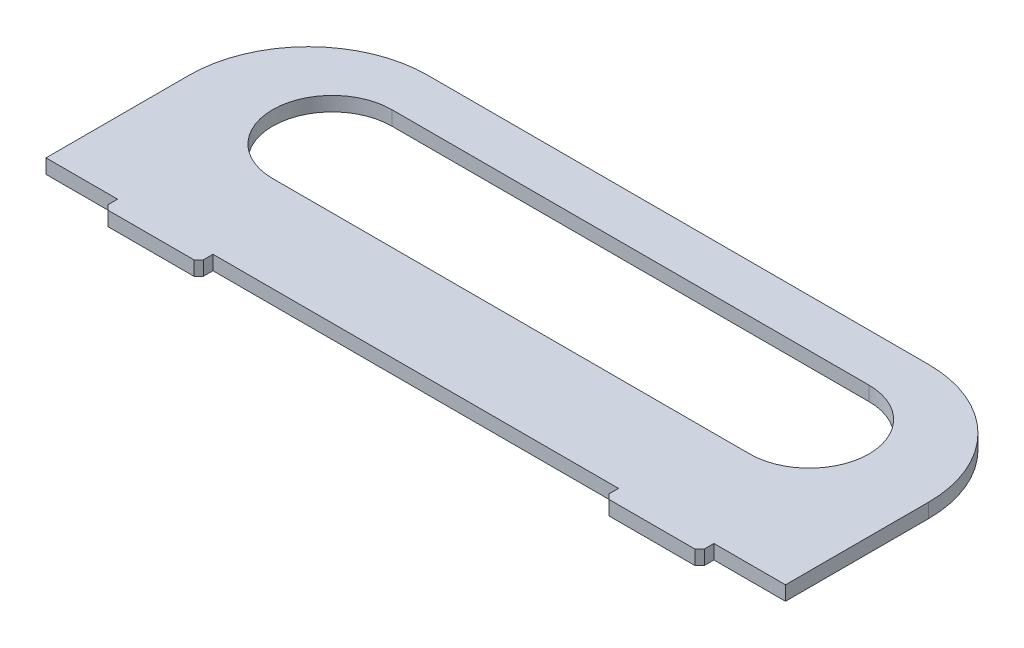
ISO-10303-21;
HEADER;
FILE_DESCRIPTION(('STEP AP214'),'2;1');
FILE_NAME('part.step','',(''),(''),'','','');
FILE_SCHEMA(('AUTOMOTIVE_DESIGN { 1 0 10303 214 1 1 1 1 }'));
ENDSEC;
DATA;
#1=APPLICATION_CONTEXT('core data for automotive mechanical design processes');
#2=APPLICATION_PROTOCOL_DEFINITION('international standard','automotive_design',2000,#1);
#3=PRODUCT_CONTEXT('',#1,'mechanical');
#4=PRODUCT('Part','Part','',(#3));
#5=PRODUCT_RELATED_PRODUCT_CATEGORY('part','',(#4));
#6=PRODUCT_DEFINITION_FORMATION('','',#4);
#7=PRODUCT_DEFINITION_CONTEXT('part definition',#1,'design');
#8=PRODUCT_DEFINITION('design','',#6,#7);
#9=PRODUCT_DEFINITION_SHAPE('','',#8);
#10=(LENGTH_UNIT() NAMED_UNIT(*) SI_UNIT(.MILLI.,.METRE.));
#11=(NAMED_UNIT(*) PLANE_ANGLE_UNIT() SI_UNIT($,.RADIAN.));
#12=(NAMED_UNIT(*) SI_UNIT($,.STERADIAN.) SOLID_ANGLE_UNIT());
#13=UNCERTAINTY_MEASURE_WITH_UNIT(LENGTH_MEASURE(1.E-05),#10,'distance_accuracy_value','');
#14=(GEOMETRIC_REPRESENTATION_CONTEXT(3) GLOBAL_UNCERTAINTY_ASSIGNED_CONTEXT((#13)) GLOBAL_UNIT_ASSIGNED_CONTEXT((#10,
#11,#12)) REPRESENTATION_CONTEXT('',''));
#15=CARTESIAN_POINT('',(0.,0.,0.));
#16=DIRECTION('',(0.,0.,1.));
#17=DIRECTION('',(1.,0.,0.));
#18=AXIS2_PLACEMENT_3D('',#15,#16,#17);
#19=CARTESIAN_POINT('',(-77.5,3.,27.5));
#20=DIRECTION('',(0.,0.,-1.));
#21=DIRECTION('',(-1.,0.,0.));
#22=AXIS2_PLACEMENT_3D('',#19,#20,#21);
#23=PLANE('',#22);
#24=CARTESIAN_POINT('',(42.5,3.,27.5));
#25=CARTESIAN_POINT('',(42.5,0.,27.5));
#26=B_SPLINE_CURVE_WITH_KNOTS('',1,(#24,#25),.UNSPECIFIED.,.F.,.F.,(2,2),(0.,
0.0652173913043478),.UNSPECIFIED.);
#27=CARTESIAN_POINT('',(42.5,3.,27.5));
#28=VERTEX_POINT('',#27);
#29=CARTESIAN_POINT('',(42.5,0.,27.5));
#30=VERTEX_POINT('',#29);
#31=EDGE_CURVE('E77',#28,#30,#26,.T.);
#32=ORIENTED_EDGE('',*,*,#31,.F.);
#33=DIRECTION('',(1.,0.,0.));
#34=VECTOR('',#33,1.);
#35=CARTESIAN_POINT('',(-77.5,3.,27.5));
#36=LINE('',#35,#34);
#37=CARTESIAN_POINT('',(-42.5,3.,27.5));
#38=VERTEX_POINT('',#37);
#39=EDGE_CURVE('E217',#38,#28,#36,.T.);
#40=ORIENTED_EDGE('',*,*,#39,.F.);
#41=CARTESIAN_POINT('',(-42.5,0.,27.5));
#42=CARTESIAN_POINT('',(-42.5,3.,27.5));
#43=B_SPLINE_CURVE_WITH_KNOTS('',1,(#41,#42),.UNSPECIFIED.,.F.,.F.,(2,2),(0.5,
0.565217391304348),.UNSPECIFIED.);
#44=CARTESIAN_POINT('',(-42.5,0.,27.5));
#45=VERTEX_POINT('',#44);
#46=EDGE_CURVE('E283',#45,#38,#43,.T.);
#47=ORIENTED_EDGE('',*,*,#46,.F.);
#48=DIRECTION('',(1.,0.,0.));
#49=VECTOR('',#48,1.);
#50=CARTESIAN_POINT('',(-77.5,0.,27.5));
#51=LINE('',#50,#49);
#52=EDGE_CURVE('E374',#45,#30,#51,.T.);
#53=ORIENTED_EDGE('',*,*,#52,.T.);
#54=EDGE_LOOP('',(#32,#40,#47,#53));
#55=FACE_BOUND('',#54,.T.);
#56=ADVANCED_FACE('F62',(#55),#23,.F.);
#57=CARTESIAN_POINT('',(62.5,0.,27.5));
#58=CARTESIAN_POINT('',(62.5,3.,27.5));
#59=B_SPLINE_CURVE_WITH_KNOTS('',1,(#57,#58),.UNSPECIFIED.,.F.,.F.,(2,2),(0.5,
0.565217391304348),.UNSPECIFIED.);
#60=CARTESIAN_POINT('',(62.5,0.,27.5));
#61=VERTEX_POINT('',#60);
#62=CARTESIAN_POINT('',(62.5,3.,27.5));
#63=VERTEX_POINT('',#62);
#64=EDGE_CURVE('E85',#61,#63,#59,.T.);
#65=ORIENTED_EDGE('',*,*,#64,.F.);
#66=CARTESIAN_POINT('',(77.5,0.,27.5));
#67=VERTEX_POINT('',#66);
#68=EDGE_CURVE('E372',#61,#67,#51,.T.);
#69=ORIENTED_EDGE('',*,*,#68,.T.);
#70=DIRECTION('',(0.,-1.,0.));
#71=VECTOR('',#70,1.);
#72=CARTESIAN_POINT('',(77.5,3.,27.5));
#73=LINE('',#72,#71);
#74=CARTESIAN_POINT('',(77.5,3.,27.5));
#75=VERTEX_POINT('',#74);
#76=EDGE_CURVE('E213',#75,#67,#73,.T.);
#77=ORIENTED_EDGE('',*,*,#76,.F.);
#78=EDGE_CURVE('E209',#63,#75,#36,.T.);
#79=ORIENTED_EDGE('',*,*,#78,.F.);
#80=EDGE_LOOP('',(#65,#69,#77,#79));
#81=FACE_BOUND('',#80,.T.);
#82=ADVANCED_FACE('F211',(#81),#23,.F.);
#83=CARTESIAN_POINT('',(-62.5,3.,27.5));
#84=CARTESIAN_POINT('',(-62.5,0.,27.5));
#85=B_SPLINE_CURVE_WITH_KNOTS('',1,(#83,#84),.UNSPECIFIED.,.F.,.F.,(2,2),(0.,
0.0652173913043478),.UNSPECIFIED.);
#86=CARTESIAN_POINT('',(-62.5,3.,27.5));
#87=VERTEX_POINT('',#86);
#88=CARTESIAN_POINT('',(-62.5,0.,27.5));
#89=VERTEX_POINT('',#88);
#90=EDGE_CURVE('E273',#87,#89,#85,.T.);
#91=ORIENTED_EDGE('',*,*,#90,.F.);
#92=CARTESIAN_POINT('',(-77.5,3.,27.5));
#93=VERTEX_POINT('',#92);
#94=EDGE_CURVE('E220',#93,#87,#36,.T.);
#95=ORIENTED_EDGE('',*,*,#94,.F.);
#96=DIRECTION('',(0.,-1.,0.));
#97=VECTOR('',#96,1.);
#98=CARTESIAN_POINT('',(-77.5,3.,27.5));
#99=LINE('',#98,#97);
#100=CARTESIAN_POINT('',(-77.5,0.,27.5));
#101=VERTEX_POINT('',#100);
#102=EDGE_CURVE('E376',#93,#101,#99,.T.);
#103=ORIENTED_EDGE('',*,*,#102,.T.);
#104=EDGE_CURVE('E360',#101,#89,#51,.T.);
#105=ORIENTED_EDGE('',*,*,#104,.T.);
#106=EDGE_LOOP('',(#91,#95,#103,#105));
#107=FACE_BOUND('',#106,.T.);
#108=ADVANCED_FACE('F419',(#107),#23,.F.);
#109=CARTESIAN_POINT('',(0.,3.,0.));
#110=DIRECTION('',(0.,-1.,0.));
#111=DIRECTION('',(0.,0.,-1.));
#112=AXIS2_PLACEMENT_3D('',#109,#110,#111);
#113=PLANE('',#112);
#114=DIRECTION('',(0.,0.,-1.));
#115=VECTOR('',#114,1.);
#116=CARTESIAN_POINT('',(77.5,3.,27.5));
#117=LINE('',#116,#115);
#118=CARTESIAN_POINT('',(77.5,3.,-2.49999999999999));
#119=VERTEX_POINT('',#118);
#120=EDGE_CURVE('E357',#75,#119,#117,.T.);
#121=ORIENTED_EDGE('',*,*,#120,.T.);
#122=CARTESIAN_POINT('',(52.5,3.,-2.49999999999999));
#123=DIRECTION('',(0.,-1.,0.));
#124=DIRECTION('',(0.,0.,-1.));
#125=AXIS2_PLACEMENT_3D('',#122,#123,#124);
#126=CIRCLE('',#125,25.);
#127=CARTESIAN_POINT('',(52.5,3.,-27.5));
#128=VERTEX_POINT('',#127);
#129=EDGE_CURVE('E70',#119,#128,#126,.F.);
#130=ORIENTED_EDGE('',*,*,#129,.T.);
#131=DIRECTION('',(-1.,0.,0.));
#132=VECTOR('',#131,1.);
#133=CARTESIAN_POINT('',(-77.5,3.,-27.5));
#134=LINE('',#133,#132);
#135=CARTESIAN_POINT('',(-52.5,3.,-27.5));
#136=VERTEX_POINT('',#135);
#137=EDGE_CURVE('E359',#128,#136,#134,.T.);
#138=ORIENTED_EDGE('',*,*,#137,.T.);
#139=CARTESIAN_POINT('',(-52.5,3.,-2.49999999999999));
#140=DIRECTION('',(0.,-1.,0.));
#141=DIRECTION('',(0.,0.,-1.));
#142=AXIS2_PLACEMENT_3D('',#139,#140,#141);
#143=CIRCLE('',#142,25.);
#144=CARTESIAN_POINT('',(-77.5,3.,-2.49999999999999));
#145=VERTEX_POINT('',#144);
#146=EDGE_CURVE('E390',#136,#145,#143,.F.);
#147=ORIENTED_EDGE('',*,*,#146,.T.);
#148=DIRECTION('',(0.,0.,1.));
#149=VECTOR('',#148,1.);
#150=CARTESIAN_POINT('',(-77.5,3.,27.5));
#151=LINE('',#150,#149);
#152=EDGE_CURVE('E218',#145,#93,#151,.T.);
#153=ORIENTED_EDGE('',*,*,#152,.T.);
#154=ORIENTED_EDGE('',*,*,#94,.T.);
#155=DIRECTION('',(0.,0.,-1.));
#156=VECTOR('',#155,1.);
#157=CARTESIAN_POINT('',(-62.5,3.,33.5));
#158=LINE('',#157,#156);
#159=CARTESIAN_POINT('',(-62.5,3.,29.5));
#160=VERTEX_POINT('',#159);
#161=EDGE_CURVE('E291',#160,#87,#158,.T.);
#162=ORIENTED_EDGE('',*,*,#161,.F.);
#163=DIRECTION('',(-0.707106781186547,0.,-0.707106781186548));
#164=VECTOR('',#163,1.);
#165=CARTESIAN_POINT('',(-62.5,3.,29.5));
#166=LINE('',#165,#164);
#167=CARTESIAN_POINT('',(-61.5,3.,30.5));
#168=VERTEX_POINT('',#167);
#169=EDGE_CURVE('E312',#160,#168,#166,.F.);
#170=ORIENTED_EDGE('',*,*,#169,.T.);
#171=DIRECTION('',(1.,0.,0.));
#172=VECTOR('',#171,1.);
#173=CARTESIAN_POINT('',(-42.5,3.,30.5));
#174=LINE('',#173,#172);
#175=CARTESIAN_POINT('',(-43.5,3.,30.5));
#176=VERTEX_POINT('',#175);
#177=EDGE_CURVE('E278',#168,#176,#174,.T.);
#178=ORIENTED_EDGE('',*,*,#177,.T.);
#179=DIRECTION('',(-0.707106781186547,0.,0.707106781186548));
#180=VECTOR('',#179,1.);
#181=CARTESIAN_POINT('',(-42.5,3.,29.5));
#182=LINE('',#181,#180);
#183=CARTESIAN_POINT('',(-42.5,3.,29.5));
#184=VERTEX_POINT('',#183);
#185=EDGE_CURVE('E310',#176,#184,#182,.F.);
#186=ORIENTED_EDGE('',*,*,#185,.T.);
#187=DIRECTION('',(0.,0.,-1.));
#188=VECTOR('',#187,1.);
#189=CARTESIAN_POINT('',(-42.5,3.,33.5));
#190=LINE('',#189,#188);
#191=EDGE_CURVE('E297',#184,#38,#190,.T.);
#192=ORIENTED_EDGE('',*,*,#191,.T.);
#193=ORIENTED_EDGE('',*,*,#39,.T.);
#194=DIRECTION('',(0.,0.,-1.));
#195=VECTOR('',#194,1.);
#196=CARTESIAN_POINT('',(42.5,3.,33.5));
#197=LINE('',#196,#195);
#198=CARTESIAN_POINT('',(42.5,3.,29.5));
#199=VERTEX_POINT('',#198);
#200=EDGE_CURVE('E232',#199,#28,#197,.T.);
#201=ORIENTED_EDGE('',*,*,#200,.F.);
#202=DIRECTION('',(-0.707106781186547,0.,-0.707106781186548));
#203=VECTOR('',#202,1.);
#204=CARTESIAN_POINT('',(42.5,3.,29.5));
#205=LINE('',#204,#203);
#206=CARTESIAN_POINT('',(43.5,3.,30.5));
#207=VERTEX_POINT('',#206);
#208=EDGE_CURVE('E261',#199,#207,#205,.F.);
#209=ORIENTED_EDGE('',*,*,#208,.T.);
#210=DIRECTION('',(1.,0.,0.));
#211=VECTOR('',#210,1.);
#212=CARTESIAN_POINT('',(62.5,3.,30.5));
#213=LINE('',#212,#211);
#214=CARTESIAN_POINT('',(61.5,3.,30.5));
#215=VERTEX_POINT('',#214);
#216=EDGE_CURVE('E254',#207,#215,#213,.T.);
#217=ORIENTED_EDGE('',*,*,#216,.T.);
#218=DIRECTION('',(-0.707106781186547,0.,0.707106781186548));
#219=VECTOR('',#218,1.);
#220=CARTESIAN_POINT('',(62.5,3.,29.5));
#221=LINE('',#220,#219);
#222=CARTESIAN_POINT('',(62.5,3.,29.5));
#223=VERTEX_POINT('',#222);
#224=EDGE_CURVE('E227',#215,#223,#221,.F.);
#225=ORIENTED_EDGE('',*,*,#224,.T.);
#226=DIRECTION('',(0.,0.,-1.));
#227=VECTOR('',#226,1.);
#228=CARTESIAN_POINT('',(62.5,3.,33.5));
#229=LINE('',#228,#227);
#230=EDGE_CURVE('E222',#223,#63,#229,.T.);
#231=ORIENTED_EDGE('',*,*,#230,.T.);
#232=ORIENTED_EDGE('',*,*,#78,.T.);
#233=EDGE_LOOP('',(#121,#130,#138,#147,#153,#154,#162,#170,#178,#186,#192,#193,#201,#209,#217,
#225,#231,#232));
#234=FACE_BOUND('',#233,.T.);
#235=CARTESIAN_POINT('',(-50.,3.,-4.99999999999999));
#236=DIRECTION('',(0.,1.,0.));
#237=DIRECTION('',(0.,0.,1.));
#238=AXIS2_PLACEMENT_3D('',#235,#236,#237);
#239=CIRCLE('',#238,12.5);
#240=CARTESIAN_POINT('',(-50.,3.,-17.5));
#241=VERTEX_POINT('',#240);
#242=CARTESIAN_POINT('',(-50.,3.,7.50000000000001));
#243=VERTEX_POINT('',#242);
#244=EDGE_CURVE('E326',#241,#243,#239,.T.);
#245=ORIENTED_EDGE('',*,*,#244,.F.);
#246=DIRECTION('',(-1.,0.,0.));
#247=VECTOR('',#246,1.);
#248=CARTESIAN_POINT('',(-50.,3.,-17.5));
#249=LINE('',#248,#247);
#250=CARTESIAN_POINT('',(50.,3.,-17.5));
#251=VERTEX_POINT('',#250);
#252=EDGE_CURVE('E334',#251,#241,#249,.T.);
#253=ORIENTED_EDGE('',*,*,#252,.F.);
#254=CARTESIAN_POINT('',(50.,3.,-4.99999999999999));
#255=DIRECTION('',(0.,1.,0.));
#256=DIRECTION('',(0.,0.,1.));
#257=AXIS2_PLACEMENT_3D('',#254,#255,#256);
#258=CIRCLE('',#257,12.5);
#259=CARTESIAN_POINT('',(50.,3.,7.50000000000001));
#260=VERTEX_POINT('',#259);
#261=EDGE_CURVE('E331',#260,#251,#258,.T.);
#262=ORIENTED_EDGE('',*,*,#261,.F.);
#263=DIRECTION('',(1.,0.,0.));
#264=VECTOR('',#263,1.);
#265=CARTESIAN_POINT('',(-50.,3.,7.50000000000001));
#266=LINE('',#265,#264);
#267=EDGE_CURVE('E328',#243,#260,#266,.T.);
#268=ORIENTED_EDGE('',*,*,#267,.F.);
#269=EDGE_LOOP('',(#245,#253,#262,#268));
#270=FACE_BOUND('',#269,.T.);
#271=ADVANCED_FACE('F223',(#234,#270),#113,.F.);
#272=CARTESIAN_POINT('',(0.,0.,0.));
#273=DIRECTION('',(0.,-1.,0.));
#274=DIRECTION('',(0.,0.,-1.));
#275=AXIS2_PLACEMENT_3D('',#272,#273,#274);
#276=PLANE('',#275);
#277=DIRECTION('',(-1.,0.,0.));
#278=VECTOR('',#277,1.);
#279=CARTESIAN_POINT('',(-77.5,0.,-27.5));
#280=LINE('',#279,#278);
#281=CARTESIAN_POINT('',(52.5,0.,-27.5));
#282=VERTEX_POINT('',#281);
#283=CARTESIAN_POINT('',(-52.5,0.,-27.5));
#284=VERTEX_POINT('',#283);
#285=EDGE_CURVE('E367',#282,#284,#280,.T.);
#286=ORIENTED_EDGE('',*,*,#285,.F.);
#287=CARTESIAN_POINT('',(52.5,0.,-2.49999999999999));
#288=DIRECTION('',(0.,-1.,0.));
#289=DIRECTION('',(0.,0.,-1.));
#290=AXIS2_PLACEMENT_3D('',#287,#288,#289);
#291=CIRCLE('',#290,25.);
#292=CARTESIAN_POINT('',(77.5,0.,-2.49999999999999));
#293=VERTEX_POINT('',#292);
#294=EDGE_CURVE('E386',#282,#293,#291,.T.);
#295=ORIENTED_EDGE('',*,*,#294,.T.);
#296=DIRECTION('',(0.,0.,-1.));
#297=VECTOR('',#296,1.);
#298=CARTESIAN_POINT('',(77.5,0.,27.5));
#299=LINE('',#298,#297);
#300=EDGE_CURVE('E356',#67,#293,#299,.T.);
#301=ORIENTED_EDGE('',*,*,#300,.F.);
#302=ORIENTED_EDGE('',*,*,#68,.F.);
#303=DIRECTION('',(0.,0.,-1.));
#304=VECTOR('',#303,1.);
#305=CARTESIAN_POINT('',(62.5,0.,33.5));
#306=LINE('',#305,#304);
#307=CARTESIAN_POINT('',(62.5,0.,29.5));
#308=VERTEX_POINT('',#307);
#309=EDGE_CURVE('E231',#308,#61,#306,.T.);
#310=ORIENTED_EDGE('',*,*,#309,.F.);
#311=DIRECTION('',(0.707106781186547,0.,-0.707106781186548));
#312=VECTOR('',#311,1.);
#313=CARTESIAN_POINT('',(62.5,0.,29.5));
#314=LINE('',#313,#312);
#315=CARTESIAN_POINT('',(61.5,0.,30.5));
#316=VERTEX_POINT('',#315);
#317=EDGE_CURVE('E267',#308,#316,#314,.F.);
#318=ORIENTED_EDGE('',*,*,#317,.T.);
#319=DIRECTION('',(-1.,0.,0.));
#320=VECTOR('',#319,1.);
#321=CARTESIAN_POINT('',(42.5,0.,30.5));
#322=LINE('',#321,#320);
#323=CARTESIAN_POINT('',(43.5,0.,30.5));
#324=VERTEX_POINT('',#323);
#325=EDGE_CURVE('E256',#316,#324,#322,.T.);
#326=ORIENTED_EDGE('',*,*,#325,.T.);
#327=DIRECTION('',(0.707106781186547,0.,0.707106781186548));
#328=VECTOR('',#327,1.);
#329=CARTESIAN_POINT('',(42.5,0.,29.5));
#330=LINE('',#329,#328);
#331=CARTESIAN_POINT('',(42.5,0.,29.5));
#332=VERTEX_POINT('',#331);
#333=EDGE_CURVE('E269',#324,#332,#330,.F.);
#334=ORIENTED_EDGE('',*,*,#333,.T.);
#335=DIRECTION('',(0.,0.,-1.));
#336=VECTOR('',#335,1.);
#337=CARTESIAN_POINT('',(42.5,0.,33.5));
#338=LINE('',#337,#336);
#339=EDGE_CURVE('E251',#332,#30,#338,.T.);
#340=ORIENTED_EDGE('',*,*,#339,.T.);
#341=ORIENTED_EDGE('',*,*,#52,.F.);
#342=DIRECTION('',(0.,0.,-1.));
#343=VECTOR('',#342,1.);
#344=CARTESIAN_POINT('',(-42.5,0.,33.5));
#345=LINE('',#344,#343);
#346=CARTESIAN_POINT('',(-42.5,0.,29.5));
#347=VERTEX_POINT('',#346);
#348=EDGE_CURVE('E300',#347,#45,#345,.T.);
#349=ORIENTED_EDGE('',*,*,#348,.F.);
#350=DIRECTION('',(0.707106781186547,0.,-0.707106781186548));
#351=VECTOR('',#350,1.);
#352=CARTESIAN_POINT('',(-42.5,0.,29.5));
#353=LINE('',#352,#351);
#354=CARTESIAN_POINT('',(-43.5,0.,30.5));
#355=VERTEX_POINT('',#354);
#356=EDGE_CURVE('E318',#347,#355,#353,.F.);
#357=ORIENTED_EDGE('',*,*,#356,.T.);
#358=DIRECTION('',(-1.,0.,0.));
#359=VECTOR('',#358,1.);
#360=CARTESIAN_POINT('',(-62.5,0.,30.5));
#361=LINE('',#360,#359);
#362=CARTESIAN_POINT('',(-61.5,0.,30.5));
#363=VERTEX_POINT('',#362);
#364=EDGE_CURVE('E274',#355,#363,#361,.T.);
#365=ORIENTED_EDGE('',*,*,#364,.T.);
#366=DIRECTION('',(0.707106781186547,0.,0.707106781186548));
#367=VECTOR('',#366,1.);
#368=CARTESIAN_POINT('',(-62.5,0.,29.5));
#369=LINE('',#368,#367);
#370=CARTESIAN_POINT('',(-62.5,0.,29.5));
#371=VERTEX_POINT('',#370);
#372=EDGE_CURVE('E320',#363,#371,#369,.F.);
#373=ORIENTED_EDGE('',*,*,#372,.T.);
#374=DIRECTION('',(0.,0.,-1.));
#375=VECTOR('',#374,1.);
#376=CARTESIAN_POINT('',(-62.5,0.,33.5));
#377=LINE('',#376,#375);
#378=EDGE_CURVE('E303',#371,#89,#377,.T.);
#379=ORIENTED_EDGE('',*,*,#378,.T.);
#380=ORIENTED_EDGE('',*,*,#104,.F.);
#381=DIRECTION('',(0.,0.,1.));
#382=VECTOR('',#381,1.);
#383=CARTESIAN_POINT('',(-77.5,0.,27.5));
#384=LINE('',#383,#382);
#385=CARTESIAN_POINT('',(-77.5,0.,-2.49999999999999));
#386=VERTEX_POINT('',#385);
#387=EDGE_CURVE('E370',#386,#101,#384,.T.);
#388=ORIENTED_EDGE('',*,*,#387,.F.);
#389=CARTESIAN_POINT('',(-52.5,0.,-2.49999999999999));
#390=DIRECTION('',(0.,-1.,0.));
#391=DIRECTION('',(0.,0.,-1.));
#392=AXIS2_PLACEMENT_3D('',#389,#390,#391);
#393=CIRCLE('',#392,25.);
#394=EDGE_CURVE('E384',#386,#284,#393,.T.);
#395=ORIENTED_EDGE('',*,*,#394,.T.);
#396=EDGE_LOOP('',(#286,#295,#301,#302,#310,#318,#326,#334,#340,#341,#349,#357,#365,#373,#379,
#380,#388,#395));
#397=FACE_BOUND('',#396,.T.);
#398=DIRECTION('',(-1.,0.,0.));
#399=VECTOR('',#398,1.);
#400=CARTESIAN_POINT('',(-50.,0.,-17.5));
#401=LINE('',#400,#399);
#402=CARTESIAN_POINT('',(50.,0.,-17.5));
#403=VERTEX_POINT('',#402);
#404=CARTESIAN_POINT('',(-50.,0.,-17.5));
#405=VERTEX_POINT('',#404);
#406=EDGE_CURVE('E329',#403,#405,#401,.T.);
#407=ORIENTED_EDGE('',*,*,#406,.T.);
#408=CARTESIAN_POINT('',(-50.,0.,-4.99999999999999));
#409=DIRECTION('',(0.,1.,0.));
#410=DIRECTION('',(0.,0.,1.));
#411=AXIS2_PLACEMENT_3D('',#408,#409,#410);
#412=CIRCLE('',#411,12.5);
#413=CARTESIAN_POINT('',(-50.,0.,7.50000000000001));
#414=VERTEX_POINT('',#413);
#415=EDGE_CURVE('E325',#405,#414,#412,.T.);
#416=ORIENTED_EDGE('',*,*,#415,.T.);
#417=DIRECTION('',(1.,0.,0.));
#418=VECTOR('',#417,1.);
#419=CARTESIAN_POINT('',(-50.,0.,7.50000000000001));
#420=LINE('',#419,#418);
#421=CARTESIAN_POINT('',(50.,0.,7.50000000000001));
#422=VERTEX_POINT('',#421);
#423=EDGE_CURVE('E339',#414,#422,#420,.T.);
#424=ORIENTED_EDGE('',*,*,#423,.T.);
#425=CARTESIAN_POINT('',(50.,0.,-4.99999999999999));
#426=DIRECTION('',(0.,1.,0.));
#427=DIRECTION('',(0.,0.,1.));
#428=AXIS2_PLACEMENT_3D('',#425,#426,#427);
#429=CIRCLE('',#428,12.5);
#430=EDGE_CURVE('E342',#422,#403,#429,.T.);
#431=ORIENTED_EDGE('',*,*,#430,.T.);
#432=EDGE_LOOP('',(#407,#416,#424,#431));
#433=FACE_BOUND('',#432,.T.);
#434=ADVANCED_FACE('F404',(#397,#433),#276,.T.);
#435=CARTESIAN_POINT('',(77.5,3.,27.5));
#436=DIRECTION('',(-1.,0.,0.));
#437=DIRECTION('',(0.,0.,1.));
#438=AXIS2_PLACEMENT_3D('',#435,#436,#437);
#439=PLANE('',#438);
#440=ORIENTED_EDGE('',*,*,#300,.T.);
#441=DIRECTION('',(0.,-1.,0.));
#442=VECTOR('',#441,1.);
#443=CARTESIAN_POINT('',(77.5,3.,-2.49999999999999));
#444=LINE('',#443,#442);
#445=EDGE_CURVE('E388',#293,#119,#444,.F.);
#446=ORIENTED_EDGE('',*,*,#445,.T.);
#447=ORIENTED_EDGE('',*,*,#120,.F.);
#448=ORIENTED_EDGE('',*,*,#76,.T.);
#449=EDGE_LOOP('',(#440,#446,#447,#448));
#450=FACE_BOUND('',#449,.T.);
#451=ADVANCED_FACE('F407',(#450),#439,.F.);
#452=CARTESIAN_POINT('',(-77.5,3.,-27.5));
#453=DIRECTION('',(0.,0.,1.));
#454=DIRECTION('',(1.,0.,0.));
#455=AXIS2_PLACEMENT_3D('',#452,#453,#454);
#456=PLANE('',#455);
#457=ORIENTED_EDGE('',*,*,#137,.F.);
#458=DIRECTION('',(0.,-1.,0.));
#459=VECTOR('',#458,1.);
#460=CARTESIAN_POINT('',(52.5,3.,-27.5));
#461=LINE('',#460,#459);
#462=EDGE_CURVE('E381',#128,#282,#461,.T.);
#463=ORIENTED_EDGE('',*,*,#462,.T.);
#464=ORIENTED_EDGE('',*,*,#285,.T.);
#465=DIRECTION('',(0.,-1.,0.));
#466=VECTOR('',#465,1.);
#467=CARTESIAN_POINT('',(-52.5,3.,-27.5));
#468=LINE('',#467,#466);
#469=EDGE_CURVE('E379',#284,#136,#468,.F.);
#470=ORIENTED_EDGE('',*,*,#469,.T.);
#471=EDGE_LOOP('',(#457,#463,#464,#470));
#472=FACE_BOUND('',#471,.T.);
#473=ADVANCED_FACE('F398',(#472),#456,.F.);
#474=CARTESIAN_POINT('',(-77.5,3.,27.5));
#475=DIRECTION('',(1.,0.,0.));
#476=DIRECTION('',(0.,0.,-1.));
#477=AXIS2_PLACEMENT_3D('',#474,#475,#476);
#478=PLANE('',#477);
#479=ORIENTED_EDGE('',*,*,#152,.F.);
#480=DIRECTION('',(0.,-1.,0.));
#481=VECTOR('',#480,1.);
#482=CARTESIAN_POINT('',(-77.5,3.,-2.49999999999999));
#483=LINE('',#482,#481);
#484=EDGE_CURVE('E13',#145,#386,#483,.T.);
#485=ORIENTED_EDGE('',*,*,#484,.T.);
#486=ORIENTED_EDGE('',*,*,#387,.T.);
#487=ORIENTED_EDGE('',*,*,#102,.F.);
#488=EDGE_LOOP('',(#479,#485,#486,#487));
#489=FACE_BOUND('',#488,.T.);
#490=ADVANCED_FACE('F414',(#489),#478,.F.);
#491=CARTESIAN_POINT('',(-50.,3.,-4.99999999999999));
#492=DIRECTION('',(0.,-1.,0.));
#493=DIRECTION('',(0.,0.,-1.));
#494=AXIS2_PLACEMENT_3D('',#491,#492,#493);
#495=CYLINDRICAL_SURFACE('',#494,12.5);
#496=ORIENTED_EDGE('',*,*,#415,.F.);
#497=DIRECTION('',(0.,-1.,0.));
#498=VECTOR('',#497,1.);
#499=CARTESIAN_POINT('',(-50.,3.,-17.5));
#500=LINE('',#499,#498);
#501=EDGE_CURVE('E336',#241,#405,#500,.T.);
#502=ORIENTED_EDGE('',*,*,#501,.F.);
#503=ORIENTED_EDGE('',*,*,#244,.T.);
#504=DIRECTION('',(0.,-1.,0.));
#505=VECTOR('',#504,1.);
#506=CARTESIAN_POINT('',(-50.,3.,7.50000000000001));
#507=LINE('',#506,#505);
#508=EDGE_CURVE('E353',#243,#414,#507,.T.);
#509=ORIENTED_EDGE('',*,*,#508,.T.);
#510=EDGE_LOOP('',(#496,#502,#503,#509));
#511=FACE_BOUND('',#510,.T.);
#512=ADVANCED_FACE('F499',(#511),#495,.F.);
#513=CARTESIAN_POINT('',(-50.,3.,7.50000000000001));
#514=DIRECTION('',(0.,0.,-1.));
#515=DIRECTION('',(-1.,0.,0.));
#516=AXIS2_PLACEMENT_3D('',#513,#514,#515);
#517=PLANE('',#516);
#518=ORIENTED_EDGE('',*,*,#423,.F.);
#519=ORIENTED_EDGE('',*,*,#508,.F.);
#520=ORIENTED_EDGE('',*,*,#267,.T.);
#521=DIRECTION('',(0.,-1.,0.));
#522=VECTOR('',#521,1.);
#523=CARTESIAN_POINT('',(50.,3.,7.50000000000001));
#524=LINE('',#523,#522);
#525=EDGE_CURVE('E351',#260,#422,#524,.T.);
#526=ORIENTED_EDGE('',*,*,#525,.T.);
#527=EDGE_LOOP('',(#518,#519,#520,#526));
#528=FACE_BOUND('',#527,.T.);
#529=ADVANCED_FACE('F495',(#528),#517,.T.);
#530=CARTESIAN_POINT('',(50.,3.,-4.99999999999999));
#531=DIRECTION('',(0.,-1.,0.));
#532=DIRECTION('',(0.,0.,-1.));
#533=AXIS2_PLACEMENT_3D('',#530,#531,#532);
#534=CYLINDRICAL_SURFACE('',#533,12.5);
#535=ORIENTED_EDGE('',*,*,#430,.F.);
#536=ORIENTED_EDGE('',*,*,#525,.F.);
#537=ORIENTED_EDGE('',*,*,#261,.T.);
#538=DIRECTION('',(0.,-1.,0.));
#539=VECTOR('',#538,1.);
#540=CARTESIAN_POINT('',(50.,3.,-17.5));
#541=LINE('',#540,#539);
#542=EDGE_CURVE('E349',#251,#403,#541,.T.);
#543=ORIENTED_EDGE('',*,*,#542,.T.);
#544=EDGE_LOOP('',(#535,#536,#537,#543));
#545=FACE_BOUND('',#544,.T.);
#546=ADVANCED_FACE('F491',(#545),#534,.F.);
#547=CARTESIAN_POINT('',(-50.,3.,-17.5));
#548=DIRECTION('',(0.,0.,1.));
#549=DIRECTION('',(1.,0.,0.));
#550=AXIS2_PLACEMENT_3D('',#547,#548,#549);
#551=PLANE('',#550);
#552=ORIENTED_EDGE('',*,*,#406,.F.);
#553=ORIENTED_EDGE('',*,*,#542,.F.);
#554=ORIENTED_EDGE('',*,*,#252,.T.);
#555=ORIENTED_EDGE('',*,*,#501,.T.);
#556=EDGE_LOOP('',(#552,#553,#554,#555));
#557=FACE_BOUND('',#556,.T.);
#558=ADVANCED_FACE('F488',(#557),#551,.T.);
#559=CARTESIAN_POINT('',(52.5,3.,-2.49999999999999));
#560=DIRECTION('',(0.,-1.,0.));
#561=DIRECTION('',(0.,0.,-1.));
#562=AXIS2_PLACEMENT_3D('',#559,#560,#561);
#563=CYLINDRICAL_SURFACE('',#562,25.);
#564=ORIENTED_EDGE('',*,*,#129,.F.);
#565=ORIENTED_EDGE('',*,*,#445,.F.);
#566=ORIENTED_EDGE('',*,*,#294,.F.);
#567=ORIENTED_EDGE('',*,*,#462,.F.);
#568=EDGE_LOOP('',(#564,#565,#566,#567));
#569=FACE_BOUND('',#568,.T.);
#570=ADVANCED_FACE('F401',(#569),#563,.T.);
#571=CARTESIAN_POINT('',(-52.5,3.,-2.49999999999999));
#572=DIRECTION('',(0.,-1.,0.));
#573=DIRECTION('',(0.,0.,-1.));
#574=AXIS2_PLACEMENT_3D('',#571,#572,#573);
#575=CYLINDRICAL_SURFACE('',#574,25.);
#576=ORIENTED_EDGE('',*,*,#146,.F.);
#577=ORIENTED_EDGE('',*,*,#469,.F.);
#578=ORIENTED_EDGE('',*,*,#394,.F.);
#579=ORIENTED_EDGE('',*,*,#484,.F.);
#580=EDGE_LOOP('',(#576,#577,#578,#579));
#581=FACE_BOUND('',#580,.T.);
#582=ADVANCED_FACE('F64',(#581),#575,.T.);
#583=CARTESIAN_POINT('',(-42.5,0.,33.5));
#584=DIRECTION('',(-1.,0.,0.));
#585=DIRECTION('',(0.,0.,1.));
#586=AXIS2_PLACEMENT_3D('',#583,#584,#585);
#587=PLANE('',#586);
#588=ORIENTED_EDGE('',*,*,#191,.F.);
#589=DIRECTION('',(0.,-1.,0.));
#590=VECTOR('',#589,1.);
#591=CARTESIAN_POINT('',(-42.5,0.,29.5));
#592=LINE('',#591,#590);
#593=EDGE_CURVE('E322',#184,#347,#592,.T.);
#594=ORIENTED_EDGE('',*,*,#593,.T.);
#595=ORIENTED_EDGE('',*,*,#348,.T.);
#596=ORIENTED_EDGE('',*,*,#46,.T.);
#597=EDGE_LOOP('',(#588,#594,#595,#596));
#598=FACE_BOUND('',#597,.T.);
#599=ADVANCED_FACE('F454',(#598),#587,.F.);
#600=CARTESIAN_POINT('',(-62.5,3.,33.5));
#601=DIRECTION('',(1.,0.,0.));
#602=DIRECTION('',(0.,0.,-1.));
#603=AXIS2_PLACEMENT_3D('',#600,#601,#602);
#604=PLANE('',#603);
#605=ORIENTED_EDGE('',*,*,#378,.F.);
#606=DIRECTION('',(0.,1.,0.));
#607=VECTOR('',#606,1.);
#608=CARTESIAN_POINT('',(-62.5,3.,29.5));
#609=LINE('',#608,#607);
#610=EDGE_CURVE('E277',#371,#160,#609,.T.);
#611=ORIENTED_EDGE('',*,*,#610,.T.);
#612=ORIENTED_EDGE('',*,*,#161,.T.);
#613=ORIENTED_EDGE('',*,*,#90,.T.);
#614=EDGE_LOOP('',(#605,#611,#612,#613));
#615=FACE_BOUND('',#614,.T.);
#616=ADVANCED_FACE('F437',(#615),#604,.F.);
#617=CARTESIAN_POINT('',(0.,-192.25,30.5));
#618=DIRECTION('',(0.,0.,-1.));
#619=DIRECTION('',(-1.,0.,0.));
#620=AXIS2_PLACEMENT_3D('',#617,#618,#619);
#621=PLANE('',#620);
#622=ORIENTED_EDGE('',*,*,#177,.F.);
#623=DIRECTION('',(0.,-1.,0.));
#624=VECTOR('',#623,1.);
#625=CARTESIAN_POINT('',(-61.5,-192.25,30.5));
#626=LINE('',#625,#624);
#627=EDGE_CURVE('E316',#168,#363,#626,.T.);
#628=ORIENTED_EDGE('',*,*,#627,.T.);
#629=ORIENTED_EDGE('',*,*,#364,.F.);
#630=DIRECTION('',(0.,1.,0.));
#631=VECTOR('',#630,1.);
#632=CARTESIAN_POINT('',(-43.5,-192.25,30.5));
#633=LINE('',#632,#631);
#634=EDGE_CURVE('E314',#355,#176,#633,.T.);
#635=ORIENTED_EDGE('',*,*,#634,.T.);
#636=EDGE_LOOP('',(#622,#628,#629,#635));
#637=FACE_BOUND('',#636,.T.);
#638=ADVANCED_FACE('F446',(#637),#621,.F.);
#639=CARTESIAN_POINT('',(-62.5,3.,29.5));
#640=DIRECTION('',(0.707106781186548,0.,-0.707106781186547));
#641=DIRECTION('',(0.,1.,0.));
#642=AXIS2_PLACEMENT_3D('',#639,#640,#641);
#643=PLANE('',#642);
#644=ORIENTED_EDGE('',*,*,#372,.F.);
#645=ORIENTED_EDGE('',*,*,#627,.F.);
#646=ORIENTED_EDGE('',*,*,#169,.F.);
#647=ORIENTED_EDGE('',*,*,#610,.F.);
#648=EDGE_LOOP('',(#644,#645,#646,#647));
#649=FACE_BOUND('',#648,.T.);
#650=ADVANCED_FACE('F441',(#649),#643,.F.);
#651=CARTESIAN_POINT('',(-42.5,0.,29.5));
#652=DIRECTION('',(-0.707106781186548,0.,-0.707106781186547));
#653=DIRECTION('',(0.,-1.,0.));
#654=AXIS2_PLACEMENT_3D('',#651,#652,#653);
#655=PLANE('',#654);
#656=ORIENTED_EDGE('',*,*,#185,.F.);
#657=ORIENTED_EDGE('',*,*,#634,.F.);
#658=ORIENTED_EDGE('',*,*,#356,.F.);
#659=ORIENTED_EDGE('',*,*,#593,.F.);
#660=EDGE_LOOP('',(#656,#657,#658,#659));
#661=FACE_BOUND('',#660,.T.);
#662=ADVANCED_FACE('F450',(#661),#655,.F.);
#663=CARTESIAN_POINT('',(62.5,0.,33.5));
#664=DIRECTION('',(-1.,0.,0.));
#665=DIRECTION('',(0.,0.,1.));
#666=AXIS2_PLACEMENT_3D('',#663,#664,#665);
#667=PLANE('',#666);
#668=ORIENTED_EDGE('',*,*,#230,.F.);
#669=DIRECTION('',(0.,-1.,0.));
#670=VECTOR('',#669,1.);
#671=CARTESIAN_POINT('',(62.5,0.,29.5));
#672=LINE('',#671,#670);
#673=EDGE_CURVE('E271',#223,#308,#672,.T.);
#674=ORIENTED_EDGE('',*,*,#673,.T.);
#675=ORIENTED_EDGE('',*,*,#309,.T.);
#676=ORIENTED_EDGE('',*,*,#64,.T.);
#677=EDGE_LOOP('',(#668,#674,#675,#676));
#678=FACE_BOUND('',#677,.T.);
#679=ADVANCED_FACE('F235',(#678),#667,.F.);
#680=CARTESIAN_POINT('',(42.5,3.,33.5));
#681=DIRECTION('',(1.,0.,0.));
#682=DIRECTION('',(0.,0.,-1.));
#683=AXIS2_PLACEMENT_3D('',#680,#681,#682);
#684=PLANE('',#683);
#685=ORIENTED_EDGE('',*,*,#339,.F.);
#686=DIRECTION('',(0.,1.,0.));
#687=VECTOR('',#686,1.);
#688=CARTESIAN_POINT('',(42.5,3.,29.5));
#689=LINE('',#688,#687);
#690=EDGE_CURVE('E257',#332,#199,#689,.T.);
#691=ORIENTED_EDGE('',*,*,#690,.T.);
#692=ORIENTED_EDGE('',*,*,#200,.T.);
#693=ORIENTED_EDGE('',*,*,#31,.T.);
#694=EDGE_LOOP('',(#685,#691,#692,#693));
#695=FACE_BOUND('',#694,.T.);
#696=ADVANCED_FACE('F642',(#695),#684,.F.);
#697=CARTESIAN_POINT('',(0.,-192.25,30.5));
#698=DIRECTION('',(0.,0.,-1.));
#699=DIRECTION('',(-1.,0.,0.));
#700=AXIS2_PLACEMENT_3D('',#697,#698,#699);
#701=PLANE('',#700);
#702=ORIENTED_EDGE('',*,*,#216,.F.);
#703=DIRECTION('',(0.,-1.,0.));
#704=VECTOR('',#703,1.);
#705=CARTESIAN_POINT('',(43.5,-192.25,30.5));
#706=LINE('',#705,#704);
#707=EDGE_CURVE('E265',#207,#324,#706,.T.);
#708=ORIENTED_EDGE('',*,*,#707,.T.);
#709=ORIENTED_EDGE('',*,*,#325,.F.);
#710=DIRECTION('',(0.,1.,0.));
#711=VECTOR('',#710,1.);
#712=CARTESIAN_POINT('',(61.5,-192.25,30.5));
#713=LINE('',#712,#711);
#714=EDGE_CURVE('E263',#316,#215,#713,.T.);
#715=ORIENTED_EDGE('',*,*,#714,.T.);
#716=EDGE_LOOP('',(#702,#708,#709,#715));
#717=FACE_BOUND('',#716,.T.);
#718=ADVANCED_FACE('F465',(#717),#701,.F.);
#719=CARTESIAN_POINT('',(42.5,3.,29.5));
#720=DIRECTION('',(0.707106781186548,0.,-0.707106781186547));
#721=DIRECTION('',(0.,1.,0.));
#722=AXIS2_PLACEMENT_3D('',#719,#720,#721);
#723=PLANE('',#722);
#724=ORIENTED_EDGE('',*,*,#333,.F.);
#725=ORIENTED_EDGE('',*,*,#707,.F.);
#726=ORIENTED_EDGE('',*,*,#208,.F.);
#727=ORIENTED_EDGE('',*,*,#690,.F.);
#728=EDGE_LOOP('',(#724,#725,#726,#727));
#729=FACE_BOUND('',#728,.T.);
#730=ADVANCED_FACE('F469',(#729),#723,.F.);
#731=CARTESIAN_POINT('',(62.5,0.,29.5));
#732=DIRECTION('',(-0.707106781186548,0.,-0.707106781186547));
#733=DIRECTION('',(0.,-1.,0.));
#734=AXIS2_PLACEMENT_3D('',#731,#732,#733);
#735=PLANE('',#734);
#736=ORIENTED_EDGE('',*,*,#224,.F.);
#737=ORIENTED_EDGE('',*,*,#714,.F.);
#738=ORIENTED_EDGE('',*,*,#317,.F.);
#739=ORIENTED_EDGE('',*,*,#673,.F.);
#740=EDGE_LOOP('',(#736,#737,#738,#739));
#741=FACE_BOUND('',#740,.T.);
#742=ADVANCED_FACE('F467',(#741),#735,.F.);
#743=CLOSED_SHELL('',(#56,#82,#108,#271,#434,#451,#473,#490,#512,#529,#546,#558,#570,#582,#599,
#616,#638,#650,#662,#679,#696,#718,#730,#742));
#744=MANIFOLD_SOLID_BREP('B2',#743);
#745=ADVANCED_BREP_SHAPE_REPRESENTATION('',(#18,#744),#14);
#746=SHAPE_DEFINITION_REPRESENTATION(#9,#745);
ENDSEC;
END-ISO-10303-21;
